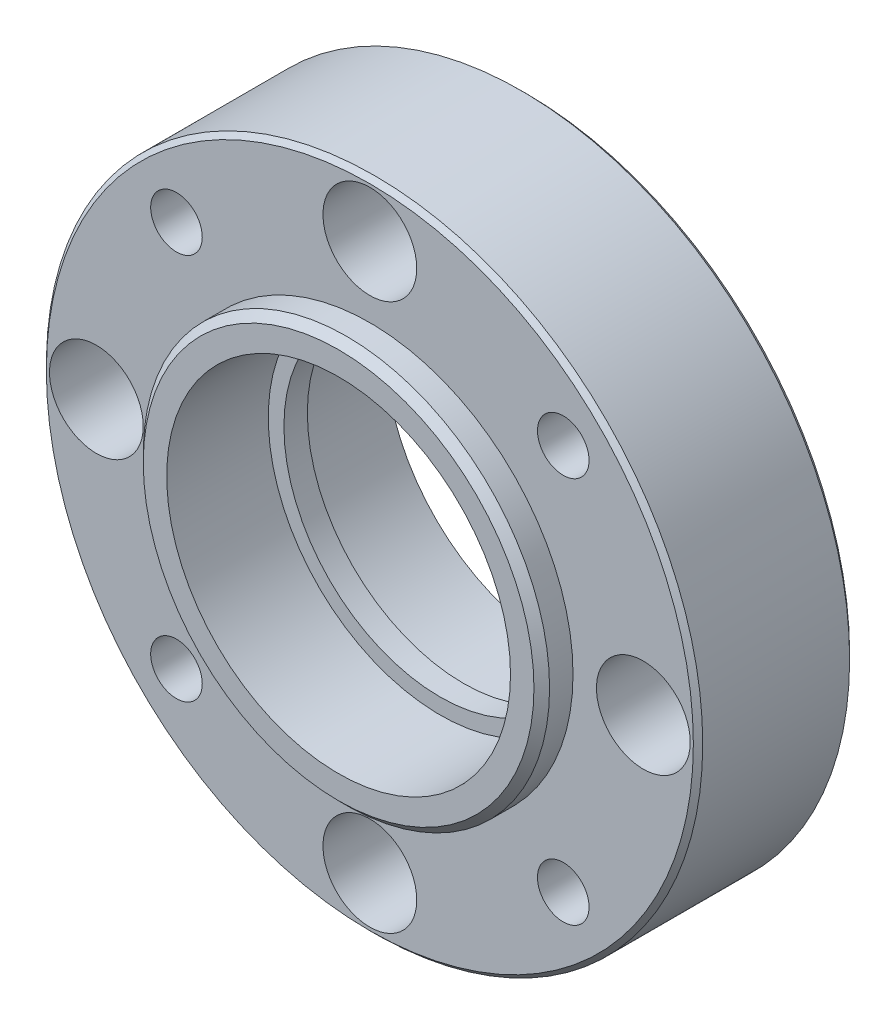
ISO-10303-21;
HEADER;
FILE_DESCRIPTION(('STEP AP214'),'2;1');
FILE_NAME('part.step','',(''),(''),'','','');
FILE_SCHEMA(('AUTOMOTIVE_DESIGN { 1 0 10303 214 1 1 1 1 }'));
ENDSEC;
DATA;
#1=APPLICATION_CONTEXT('core data for automotive mechanical design processes');
#2=APPLICATION_PROTOCOL_DEFINITION('international standard','automotive_design',2000,#1);
#3=PRODUCT_CONTEXT('',#1,'mechanical');
#4=PRODUCT('Part','Part','',(#3));
#5=PRODUCT_RELATED_PRODUCT_CATEGORY('part','',(#4));
#6=PRODUCT_DEFINITION_FORMATION('','',#4);
#7=PRODUCT_DEFINITION_CONTEXT('part definition',#1,'design');
#8=PRODUCT_DEFINITION('design','',#6,#7);
#9=PRODUCT_DEFINITION_SHAPE('','',#8);
#10=(LENGTH_UNIT() NAMED_UNIT(*) SI_UNIT(.MILLI.,.METRE.));
#11=(NAMED_UNIT(*) PLANE_ANGLE_UNIT() SI_UNIT($,.RADIAN.));
#12=(NAMED_UNIT(*) SI_UNIT($,.STERADIAN.) SOLID_ANGLE_UNIT());
#13=UNCERTAINTY_MEASURE_WITH_UNIT(LENGTH_MEASURE(1.E-05),#10,'distance_accuracy_value','');
#14=(GEOMETRIC_REPRESENTATION_CONTEXT(3) GLOBAL_UNCERTAINTY_ASSIGNED_CONTEXT((#13)) GLOBAL_UNIT_ASSIGNED_CONTEXT((#10,
#11,#12)) REPRESENTATION_CONTEXT('',''));
#15=CARTESIAN_POINT('',(0.,0.,0.));
#16=DIRECTION('',(0.,0.,1.));
#17=DIRECTION('',(1.,0.,0.));
#18=AXIS2_PLACEMENT_3D('',#15,#16,#17);
#19=CARTESIAN_POINT('',(0.,-10.,0.499999999999996));
#20=DIRECTION('',(0.,0.,1.));
#21=DIRECTION('',(1.,0.,0.));
#22=AXIS2_PLACEMENT_3D('',#19,#20,#21);
#23=PLANE('',#22);
#24=CARTESIAN_POINT('',(0.,0.,0.499999999999997));
#25=DIRECTION('',(0.,0.,1.));
#26=DIRECTION('',(1.,0.,0.));
#27=AXIS2_PLACEMENT_3D('',#24,#25,#26);
#28=CIRCLE('',#27,10.);
#29=CARTESIAN_POINT('',(10.,0.,0.499999999999997));
#30=VERTEX_POINT('',#29);
#31=EDGE_CURVE('E129',#30,#30,#28,.F.);
#32=ORIENTED_EDGE('',*,*,#31,.T.);
#33=EDGE_LOOP('',(#32));
#34=FACE_BOUND('',#33,.T.);
#35=CARTESIAN_POINT('',(0.,0.,0.499999999999997));
#36=DIRECTION('',(0.,0.,1.));
#37=DIRECTION('',(1.,0.,0.));
#38=AXIS2_PLACEMENT_3D('',#35,#36,#37);
#39=CIRCLE('',#38,11.);
#40=CARTESIAN_POINT('',(11.,0.,0.499999999999997));
#41=VERTEX_POINT('',#40);
#42=EDGE_CURVE('E17',#41,#41,#39,.T.);
#43=ORIENTED_EDGE('',*,*,#42,.T.);
#44=EDGE_LOOP('',(#43));
#45=FACE_BOUND('',#44,.T.);
#46=ADVANCED_FACE('F14',(#34,#45),#23,.T.);
#47=CARTESIAN_POINT('',(0.,0.,24.1192163114095));
#48=DIRECTION('',(0.,0.,1.));
#49=DIRECTION('',(1.,0.,0.));
#50=AXIS2_PLACEMENT_3D('',#47,#48,#49);
#51=CYLINDRICAL_SURFACE('',#50,11.);
#52=CARTESIAN_POINT('',(0.,0.,7.));
#53=DIRECTION('',(0.,0.,1.));
#54=DIRECTION('',(1.,0.,0.));
#55=AXIS2_PLACEMENT_3D('',#52,#53,#54);
#56=CIRCLE('',#55,11.);
#57=CARTESIAN_POINT('',(11.,0.,7.));
#58=VERTEX_POINT('',#57);
#59=EDGE_CURVE('E127',#58,#58,#56,.F.);
#60=ORIENTED_EDGE('',*,*,#59,.F.);
#61=EDGE_LOOP('',(#60));
#62=FACE_BOUND('',#61,.T.);
#63=ORIENTED_EDGE('',*,*,#42,.F.);
#64=EDGE_LOOP('',(#63));
#65=FACE_BOUND('',#64,.T.);
#66=ADVANCED_FACE('F137',(#62,#65),#51,.F.);
#67=CARTESIAN_POINT('',(0.,0.,24.1192163114095));
#68=DIRECTION('',(0.,0.,1.));
#69=DIRECTION('',(1.,0.,0.));
#70=AXIS2_PLACEMENT_3D('',#67,#68,#69);
#71=CYLINDRICAL_SURFACE('',#70,10.);
#72=ORIENTED_EDGE('',*,*,#31,.F.);
#73=EDGE_LOOP('',(#72));
#74=FACE_BOUND('',#73,.T.);
#75=CARTESIAN_POINT('',(0.,0.,-1.));
#76=DIRECTION('',(0.,0.,1.));
#77=DIRECTION('',(1.,0.,0.));
#78=AXIS2_PLACEMENT_3D('',#75,#76,#77);
#79=CIRCLE('',#78,10.);
#80=CARTESIAN_POINT('',(10.,0.,-1.));
#81=VERTEX_POINT('',#80);
#82=EDGE_CURVE('E124',#81,#81,#79,.T.);
#83=ORIENTED_EDGE('',*,*,#82,.F.);
#84=EDGE_LOOP('',(#83));
#85=FACE_BOUND('',#84,.T.);
#86=ADVANCED_FACE('F139',(#74,#85),#71,.F.);
#87=CARTESIAN_POINT('',(0.,-11.,7.));
#88=DIRECTION('',(0.,0.,1.));
#89=DIRECTION('',(1.,0.,0.));
#90=AXIS2_PLACEMENT_3D('',#87,#88,#89);
#91=PLANE('',#90);
#92=ORIENTED_EDGE('',*,*,#59,.T.);
#93=EDGE_LOOP('',(#92));
#94=FACE_BOUND('',#93,.T.);
#95=CARTESIAN_POINT('',(0.,0.,7.));
#96=DIRECTION('',(0.,0.,-1.));
#97=DIRECTION('',(0.,1.,0.));
#98=AXIS2_PLACEMENT_3D('',#95,#96,#97);
#99=CIRCLE('',#98,12.5);
#100=CARTESIAN_POINT('',(0.,12.5,7.));
#101=VERTEX_POINT('',#100);
#102=EDGE_CURVE('E121',#101,#101,#99,.T.);
#103=ORIENTED_EDGE('',*,*,#102,.F.);
#104=EDGE_LOOP('',(#103));
#105=FACE_BOUND('',#104,.T.);
#106=ADVANCED_FACE('F146',(#94,#105),#91,.T.);
#107=CARTESIAN_POINT('',(0.,-11.,-1.));
#108=DIRECTION('',(0.,0.,-1.));
#109=DIRECTION('',(-1.,0.,0.));
#110=AXIS2_PLACEMENT_3D('',#107,#108,#109);
#111=PLANE('',#110);
#112=CARTESIAN_POINT('',(0.,0.,-1.));
#113=DIRECTION('',(0.,0.,1.));
#114=DIRECTION('',(1.,0.,0.));
#115=AXIS2_PLACEMENT_3D('',#112,#113,#114);
#116=CIRCLE('',#115,11.);
#117=CARTESIAN_POINT('',(11.,0.,-1.));
#118=VERTEX_POINT('',#117);
#119=EDGE_CURVE('E118',#118,#118,#116,.F.);
#120=ORIENTED_EDGE('',*,*,#119,.T.);
#121=EDGE_LOOP('',(#120));
#122=FACE_BOUND('',#121,.T.);
#123=ORIENTED_EDGE('',*,*,#82,.T.);
#124=EDGE_LOOP('',(#123));
#125=FACE_BOUND('',#124,.T.);
#126=ADVANCED_FACE('F261',(#122,#125),#111,.T.);
#127=CARTESIAN_POINT('',(0.,0.,6.5));
#128=DIRECTION('',(0.,0.,-1.));
#129=DIRECTION('',(0.,1.,0.));
#130=AXIS2_PLACEMENT_3D('',#127,#128,#129);
#131=CONICAL_SURFACE('',#130,13.,0.785398163397457);
#132=ORIENTED_EDGE('',*,*,#102,.T.);
#133=EDGE_LOOP('',(#132));
#134=FACE_BOUND('',#133,.T.);
#135=CARTESIAN_POINT('',(0.,0.,6.5));
#136=DIRECTION('',(0.,0.,1.));
#137=DIRECTION('',(1.,0.,0.));
#138=AXIS2_PLACEMENT_3D('',#135,#136,#137);
#139=CIRCLE('',#138,13.);
#140=CARTESIAN_POINT('',(13.,0.,6.5));
#141=VERTEX_POINT('',#140);
#142=EDGE_CURVE('E29',#141,#141,#139,.F.);
#143=ORIENTED_EDGE('',*,*,#142,.F.);
#144=EDGE_LOOP('',(#143));
#145=FACE_BOUND('',#144,.T.);
#146=ADVANCED_FACE('F257',(#134,#145),#131,.T.);
#147=CARTESIAN_POINT('',(0.,0.,24.1192163114095));
#148=DIRECTION('',(0.,0.,1.));
#149=DIRECTION('',(1.,0.,0.));
#150=AXIS2_PLACEMENT_3D('',#147,#148,#149);
#151=CYLINDRICAL_SURFACE('',#150,11.);
#152=ORIENTED_EDGE('',*,*,#119,.F.);
#153=EDGE_LOOP('',(#152));
#154=FACE_BOUND('',#153,.T.);
#155=CARTESIAN_POINT('',(0.,0.,-7.00000000000001));
#156=DIRECTION('',(0.,0.,1.));
#157=DIRECTION('',(1.,0.,0.));
#158=AXIS2_PLACEMENT_3D('',#155,#156,#157);
#159=CIRCLE('',#158,11.);
#160=CARTESIAN_POINT('',(11.,0.,-7.00000000000001));
#161=VERTEX_POINT('',#160);
#162=EDGE_CURVE('E115',#161,#161,#159,.T.);
#163=ORIENTED_EDGE('',*,*,#162,.F.);
#164=EDGE_LOOP('',(#163));
#165=FACE_BOUND('',#164,.T.);
#166=ADVANCED_FACE('F253',(#154,#165),#151,.F.);
#167=CARTESIAN_POINT('',(0.,0.,4.69999999999997));
#168=DIRECTION('',(0.,0.,-1.));
#169=DIRECTION('',(0.,1.,0.));
#170=AXIS2_PLACEMENT_3D('',#167,#168,#169);
#171=CONICAL_SURFACE('',#170,21.,0.785398163397458);
#172=CARTESIAN_POINT('',(0.,0.,4.69999999999998));
#173=DIRECTION('',(0.,0.,1.));
#174=DIRECTION('',(1.,0.,0.));
#175=AXIS2_PLACEMENT_3D('',#172,#173,#174);
#176=CIRCLE('',#175,21.);
#177=CARTESIAN_POINT('',(21.,0.,4.69999999999998));
#178=VERTEX_POINT('',#177);
#179=EDGE_CURVE('E114',#178,#178,#176,.F.);
#180=ORIENTED_EDGE('',*,*,#179,.F.);
#181=EDGE_LOOP('',(#180));
#182=FACE_BOUND('',#181,.T.);
#183=CARTESIAN_POINT('',(0.,0.,4.99999999999999));
#184=DIRECTION('',(0.,0.,-1.));
#185=DIRECTION('',(0.,1.,0.));
#186=AXIS2_PLACEMENT_3D('',#183,#184,#185);
#187=CIRCLE('',#186,20.7);
#188=CARTESIAN_POINT('',(0.,20.7,4.99999999999999));
#189=VERTEX_POINT('',#188);
#190=EDGE_CURVE('E111',#189,#189,#187,.F.);
#191=ORIENTED_EDGE('',*,*,#190,.F.);
#192=EDGE_LOOP('',(#191));
#193=FACE_BOUND('',#192,.T.);
#194=ADVANCED_FACE('F249',(#182,#193),#171,.T.);
#195=CARTESIAN_POINT('',(0.,0.,24.1192163114095));
#196=DIRECTION('',(0.,0.,1.));
#197=DIRECTION('',(1.,0.,0.));
#198=AXIS2_PLACEMENT_3D('',#195,#196,#197);
#199=CYLINDRICAL_SURFACE('',#198,13.);
#200=CARTESIAN_POINT('',(0.,0.,4.99999999999999));
#201=DIRECTION('',(0.,0.,1.));
#202=DIRECTION('',(1.,0.,0.));
#203=AXIS2_PLACEMENT_3D('',#200,#201,#202);
#204=CIRCLE('',#203,13.);
#205=CARTESIAN_POINT('',(13.,0.,4.99999999999999));
#206=VERTEX_POINT('',#205);
#207=EDGE_CURVE('E96',#206,#206,#204,.F.);
#208=ORIENTED_EDGE('',*,*,#207,.F.);
#209=EDGE_LOOP('',(#208));
#210=FACE_BOUND('',#209,.T.);
#211=ORIENTED_EDGE('',*,*,#142,.T.);
#212=EDGE_LOOP('',(#211));
#213=FACE_BOUND('',#212,.T.);
#214=ADVANCED_FACE('F245',(#210,#213),#199,.T.);
#215=CARTESIAN_POINT('',(0.,17.5,4.99999999999999));
#216=DIRECTION('',(0.,0.,1.));
#217=DIRECTION('',(1.,0.,0.));
#218=AXIS2_PLACEMENT_3D('',#215,#216,#217);
#219=CYLINDRICAL_SURFACE('',#218,3.);
#220=CARTESIAN_POINT('',(0.,17.5,0.));
#221=DIRECTION('',(0.,0.,1.));
#222=DIRECTION('',(1.,0.,0.));
#223=AXIS2_PLACEMENT_3D('',#220,#221,#222);
#224=CIRCLE('',#223,3.);
#225=CARTESIAN_POINT('',(3.,17.5,0.));
#226=VERTEX_POINT('',#225);
#227=EDGE_CURVE('E93',#226,#226,#224,.F.);
#228=ORIENTED_EDGE('',*,*,#227,.T.);
#229=EDGE_LOOP('',(#228));
#230=FACE_BOUND('',#229,.T.);
#231=CARTESIAN_POINT('',(0.,17.5,4.99999999999999));
#232=DIRECTION('',(0.,0.,1.));
#233=DIRECTION('',(1.,0.,0.));
#234=AXIS2_PLACEMENT_3D('',#231,#232,#233);
#235=CIRCLE('',#234,3.);
#236=CARTESIAN_POINT('',(3.,17.5,4.99999999999999));
#237=VERTEX_POINT('',#236);
#238=EDGE_CURVE('E108',#237,#237,#235,.F.);
#239=ORIENTED_EDGE('',*,*,#238,.F.);
#240=EDGE_LOOP('',(#239));
#241=FACE_BOUND('',#240,.T.);
#242=ADVANCED_FACE('F241',(#230,#241),#219,.F.);
#243=CARTESIAN_POINT('',(17.5,0.,4.99999999999999));
#244=DIRECTION('',(0.,0.,1.));
#245=DIRECTION('',(1.,0.,0.));
#246=AXIS2_PLACEMENT_3D('',#243,#244,#245);
#247=CYLINDRICAL_SURFACE('',#246,3.);
#248=CARTESIAN_POINT('',(17.5,0.,0.));
#249=DIRECTION('',(0.,0.,1.));
#250=DIRECTION('',(1.,0.,0.));
#251=AXIS2_PLACEMENT_3D('',#248,#249,#250);
#252=CIRCLE('',#251,3.);
#253=CARTESIAN_POINT('',(20.5,0.,0.));
#254=VERTEX_POINT('',#253);
#255=EDGE_CURVE('E90',#254,#254,#252,.F.);
#256=ORIENTED_EDGE('',*,*,#255,.T.);
#257=EDGE_LOOP('',(#256));
#258=FACE_BOUND('',#257,.T.);
#259=CARTESIAN_POINT('',(17.5,0.,4.99999999999999));
#260=DIRECTION('',(0.,0.,1.));
#261=DIRECTION('',(1.,0.,0.));
#262=AXIS2_PLACEMENT_3D('',#259,#260,#261);
#263=CIRCLE('',#262,3.);
#264=CARTESIAN_POINT('',(20.5,0.,4.99999999999999));
#265=VERTEX_POINT('',#264);
#266=EDGE_CURVE('E105',#265,#265,#263,.F.);
#267=ORIENTED_EDGE('',*,*,#266,.F.);
#268=EDGE_LOOP('',(#267));
#269=FACE_BOUND('',#268,.T.);
#270=ADVANCED_FACE('F237',(#258,#269),#247,.F.);
#271=CARTESIAN_POINT('',(0.,-17.5,4.99999999999999));
#272=DIRECTION('',(0.,0.,1.));
#273=DIRECTION('',(1.,0.,0.));
#274=AXIS2_PLACEMENT_3D('',#271,#272,#273);
#275=CYLINDRICAL_SURFACE('',#274,3.);
#276=CARTESIAN_POINT('',(0.,-17.5,0.));
#277=DIRECTION('',(0.,0.,1.));
#278=DIRECTION('',(1.,0.,0.));
#279=AXIS2_PLACEMENT_3D('',#276,#277,#278);
#280=CIRCLE('',#279,3.);
#281=CARTESIAN_POINT('',(3.,-17.5,0.));
#282=VERTEX_POINT('',#281);
#283=EDGE_CURVE('E87',#282,#282,#280,.F.);
#284=ORIENTED_EDGE('',*,*,#283,.T.);
#285=EDGE_LOOP('',(#284));
#286=FACE_BOUND('',#285,.T.);
#287=CARTESIAN_POINT('',(0.,-17.5,4.99999999999999));
#288=DIRECTION('',(0.,0.,1.));
#289=DIRECTION('',(1.,0.,0.));
#290=AXIS2_PLACEMENT_3D('',#287,#288,#289);
#291=CIRCLE('',#290,3.);
#292=CARTESIAN_POINT('',(3.,-17.5,4.99999999999999));
#293=VERTEX_POINT('',#292);
#294=EDGE_CURVE('E102',#293,#293,#291,.F.);
#295=ORIENTED_EDGE('',*,*,#294,.F.);
#296=EDGE_LOOP('',(#295));
#297=FACE_BOUND('',#296,.T.);
#298=ADVANCED_FACE('F233',(#286,#297),#275,.F.);
#299=CARTESIAN_POINT('',(-17.5,0.,4.99999999999999));
#300=DIRECTION('',(0.,0.,1.));
#301=DIRECTION('',(1.,0.,0.));
#302=AXIS2_PLACEMENT_3D('',#299,#300,#301);
#303=CYLINDRICAL_SURFACE('',#302,3.);
#304=CARTESIAN_POINT('',(-17.5,0.,0.));
#305=DIRECTION('',(0.,0.,1.));
#306=DIRECTION('',(1.,0.,0.));
#307=AXIS2_PLACEMENT_3D('',#304,#305,#306);
#308=CIRCLE('',#307,3.);
#309=CARTESIAN_POINT('',(-14.5,0.,0.));
#310=VERTEX_POINT('',#309);
#311=EDGE_CURVE('E84',#310,#310,#308,.F.);
#312=ORIENTED_EDGE('',*,*,#311,.T.);
#313=EDGE_LOOP('',(#312));
#314=FACE_BOUND('',#313,.T.);
#315=CARTESIAN_POINT('',(-17.5,0.,4.99999999999999));
#316=DIRECTION('',(0.,0.,1.));
#317=DIRECTION('',(1.,0.,0.));
#318=AXIS2_PLACEMENT_3D('',#315,#316,#317);
#319=CIRCLE('',#318,3.);
#320=CARTESIAN_POINT('',(-14.5,0.,4.99999999999999));
#321=VERTEX_POINT('',#320);
#322=EDGE_CURVE('E99',#321,#321,#319,.F.);
#323=ORIENTED_EDGE('',*,*,#322,.F.);
#324=EDGE_LOOP('',(#323));
#325=FACE_BOUND('',#324,.T.);
#326=ADVANCED_FACE('F229',(#314,#325),#303,.F.);
#327=CARTESIAN_POINT('',(0.,-13.4,-7.));
#328=DIRECTION('',(0.,0.,-1.));
#329=DIRECTION('',(-1.,0.,0.));
#330=AXIS2_PLACEMENT_3D('',#327,#328,#329);
#331=PLANE('',#330);
#332=ORIENTED_EDGE('',*,*,#162,.T.);
#333=EDGE_LOOP('',(#332));
#334=FACE_BOUND('',#333,.T.);
#335=CARTESIAN_POINT('',(0.,0.,-7.));
#336=DIRECTION('',(0.,0.,1.));
#337=DIRECTION('',(1.,0.,0.));
#338=AXIS2_PLACEMENT_3D('',#335,#336,#337);
#339=CIRCLE('',#338,12.9);
#340=CARTESIAN_POINT('',(12.9,0.,-7.));
#341=VERTEX_POINT('',#340);
#342=EDGE_CURVE('E81',#341,#341,#339,.T.);
#343=ORIENTED_EDGE('',*,*,#342,.F.);
#344=EDGE_LOOP('',(#343));
#345=FACE_BOUND('',#344,.T.);
#346=ADVANCED_FACE('F225',(#334,#345),#331,.T.);
#347=CARTESIAN_POINT('',(0.,0.,24.1192163114095));
#348=DIRECTION('',(0.,0.,1.));
#349=DIRECTION('',(1.,0.,0.));
#350=AXIS2_PLACEMENT_3D('',#347,#348,#349);
#351=CYLINDRICAL_SURFACE('',#350,21.);
#352=ORIENTED_EDGE('',*,*,#179,.T.);
#353=EDGE_LOOP('',(#352));
#354=FACE_BOUND('',#353,.T.);
#355=CARTESIAN_POINT('',(0.,0.,-4.69999999999999));
#356=DIRECTION('',(0.,0.,1.));
#357=DIRECTION('',(1.,0.,0.));
#358=AXIS2_PLACEMENT_3D('',#355,#356,#357);
#359=CIRCLE('',#358,21.);
#360=CARTESIAN_POINT('',(21.,0.,-4.69999999999998));
#361=VERTEX_POINT('',#360);
#362=EDGE_CURVE('E80',#361,#361,#359,.F.);
#363=ORIENTED_EDGE('',*,*,#362,.F.);
#364=EDGE_LOOP('',(#363));
#365=FACE_BOUND('',#364,.T.);
#366=ADVANCED_FACE('F221',(#354,#365),#351,.T.);
#367=CARTESIAN_POINT('',(0.,-13.,4.99999999999999));
#368=DIRECTION('',(0.,0.,1.));
#369=DIRECTION('',(1.,0.,0.));
#370=AXIS2_PLACEMENT_3D('',#367,#368,#369);
#371=PLANE('',#370);
#372=ORIENTED_EDGE('',*,*,#207,.T.);
#373=EDGE_LOOP('',(#372));
#374=FACE_BOUND('',#373,.T.);
#375=ORIENTED_EDGE('',*,*,#322,.T.);
#376=EDGE_LOOP('',(#375));
#377=FACE_BOUND('',#376,.T.);
#378=ORIENTED_EDGE('',*,*,#294,.T.);
#379=EDGE_LOOP('',(#378));
#380=FACE_BOUND('',#379,.T.);
#381=ORIENTED_EDGE('',*,*,#266,.T.);
#382=EDGE_LOOP('',(#381));
#383=FACE_BOUND('',#382,.T.);
#384=ORIENTED_EDGE('',*,*,#238,.T.);
#385=EDGE_LOOP('',(#384));
#386=FACE_BOUND('',#385,.T.);
#387=CARTESIAN_POINT('',(-12.3743686707646,-12.3743686707646,5.));
#388=DIRECTION('',(0.,0.,1.));
#389=DIRECTION('',(1.,0.,0.));
#390=AXIS2_PLACEMENT_3D('',#387,#388,#389);
#391=CIRCLE('',#390,1.64999999999999);
#392=CARTESIAN_POINT('',(-10.7243686707646,-12.3743686707646,5.));
#393=VERTEX_POINT('',#392);
#394=EDGE_CURVE('E68',#393,#393,#391,.F.);
#395=ORIENTED_EDGE('',*,*,#394,.T.);
#396=EDGE_LOOP('',(#395));
#397=FACE_BOUND('',#396,.T.);
#398=CARTESIAN_POINT('',(12.3743686707646,-12.3743686707646,5.));
#399=DIRECTION('',(0.,0.,1.));
#400=DIRECTION('',(1.,0.,0.));
#401=AXIS2_PLACEMENT_3D('',#398,#399,#400);
#402=CIRCLE('',#401,1.64999999999999);
#403=CARTESIAN_POINT('',(14.0243686707646,-12.3743686707646,5.));
#404=VERTEX_POINT('',#403);
#405=EDGE_CURVE('E71',#404,#404,#402,.F.);
#406=ORIENTED_EDGE('',*,*,#405,.T.);
#407=EDGE_LOOP('',(#406));
#408=FACE_BOUND('',#407,.T.);
#409=CARTESIAN_POINT('',(12.3743686707646,12.3743686707646,5.));
#410=DIRECTION('',(0.,0.,1.));
#411=DIRECTION('',(1.,0.,0.));
#412=AXIS2_PLACEMENT_3D('',#409,#410,#411);
#413=CIRCLE('',#412,1.64999999999999);
#414=CARTESIAN_POINT('',(14.0243686707646,12.3743686707646,5.));
#415=VERTEX_POINT('',#414);
#416=EDGE_CURVE('E74',#415,#415,#413,.F.);
#417=ORIENTED_EDGE('',*,*,#416,.T.);
#418=EDGE_LOOP('',(#417));
#419=FACE_BOUND('',#418,.T.);
#420=CARTESIAN_POINT('',(-12.3743686707646,12.3743686707646,5.));
#421=DIRECTION('',(0.,0.,1.));
#422=DIRECTION('',(1.,0.,0.));
#423=AXIS2_PLACEMENT_3D('',#420,#421,#422);
#424=CIRCLE('',#423,1.64999999999999);
#425=CARTESIAN_POINT('',(-10.7243686707646,12.3743686707646,5.));
#426=VERTEX_POINT('',#425);
#427=EDGE_CURVE('E77',#426,#426,#424,.F.);
#428=ORIENTED_EDGE('',*,*,#427,.T.);
#429=EDGE_LOOP('',(#428));
#430=FACE_BOUND('',#429,.T.);
#431=ORIENTED_EDGE('',*,*,#190,.T.);
#432=EDGE_LOOP('',(#431));
#433=FACE_BOUND('',#432,.T.);
#434=ADVANCED_FACE('F217',(#374,#377,#380,#383,#386,#397,#408,#419,#430,#433),#371,.T.);
#435=CARTESIAN_POINT('',(1.75,17.5,0.));
#436=DIRECTION('',(0.,0.,-1.));
#437=DIRECTION('',(-1.,0.,0.));
#438=AXIS2_PLACEMENT_3D('',#435,#436,#437);
#439=PLANE('',#438);
#440=ORIENTED_EDGE('',*,*,#227,.F.);
#441=EDGE_LOOP('',(#440));
#442=FACE_BOUND('',#441,.T.);
#443=CARTESIAN_POINT('',(0.,17.5,0.));
#444=DIRECTION('',(0.,0.,1.));
#445=DIRECTION('',(1.,0.,0.));
#446=AXIS2_PLACEMENT_3D('',#443,#444,#445);
#447=CIRCLE('',#446,1.75);
#448=CARTESIAN_POINT('',(1.75,17.5,0.));
#449=VERTEX_POINT('',#448);
#450=EDGE_CURVE('E65',#449,#449,#447,.F.);
#451=ORIENTED_EDGE('',*,*,#450,.T.);
#452=EDGE_LOOP('',(#451));
#453=FACE_BOUND('',#452,.T.);
#454=ADVANCED_FACE('F213',(#442,#453),#439,.F.);
#455=CARTESIAN_POINT('',(19.25,0.,0.));
#456=DIRECTION('',(0.,0.,-1.));
#457=DIRECTION('',(-1.,0.,0.));
#458=AXIS2_PLACEMENT_3D('',#455,#456,#457);
#459=PLANE('',#458);
#460=ORIENTED_EDGE('',*,*,#255,.F.);
#461=EDGE_LOOP('',(#460));
#462=FACE_BOUND('',#461,.T.);
#463=CARTESIAN_POINT('',(17.5,0.,0.));
#464=DIRECTION('',(0.,0.,1.));
#465=DIRECTION('',(1.,0.,0.));
#466=AXIS2_PLACEMENT_3D('',#463,#464,#465);
#467=CIRCLE('',#466,1.75);
#468=CARTESIAN_POINT('',(19.25,0.,0.));
#469=VERTEX_POINT('',#468);
#470=EDGE_CURVE('E62',#469,#469,#467,.F.);
#471=ORIENTED_EDGE('',*,*,#470,.T.);
#472=EDGE_LOOP('',(#471));
#473=FACE_BOUND('',#472,.T.);
#474=ADVANCED_FACE('F209',(#462,#473),#459,.F.);
#475=CARTESIAN_POINT('',(1.75,-17.5,0.));
#476=DIRECTION('',(0.,0.,-1.));
#477=DIRECTION('',(-1.,0.,0.));
#478=AXIS2_PLACEMENT_3D('',#475,#476,#477);
#479=PLANE('',#478);
#480=ORIENTED_EDGE('',*,*,#283,.F.);
#481=EDGE_LOOP('',(#480));
#482=FACE_BOUND('',#481,.T.);
#483=CARTESIAN_POINT('',(0.,-17.5,0.));
#484=DIRECTION('',(0.,0.,1.));
#485=DIRECTION('',(1.,0.,0.));
#486=AXIS2_PLACEMENT_3D('',#483,#484,#485);
#487=CIRCLE('',#486,1.75);
#488=CARTESIAN_POINT('',(1.75,-17.5,0.));
#489=VERTEX_POINT('',#488);
#490=EDGE_CURVE('E59',#489,#489,#487,.F.);
#491=ORIENTED_EDGE('',*,*,#490,.T.);
#492=EDGE_LOOP('',(#491));
#493=FACE_BOUND('',#492,.T.);
#494=ADVANCED_FACE('F205',(#482,#493),#479,.F.);
#495=CARTESIAN_POINT('',(-15.75,0.,0.));
#496=DIRECTION('',(0.,0.,-1.));
#497=DIRECTION('',(-1.,0.,0.));
#498=AXIS2_PLACEMENT_3D('',#495,#496,#497);
#499=PLANE('',#498);
#500=ORIENTED_EDGE('',*,*,#311,.F.);
#501=EDGE_LOOP('',(#500));
#502=FACE_BOUND('',#501,.T.);
#503=CARTESIAN_POINT('',(-17.5,0.,0.));
#504=DIRECTION('',(0.,0.,1.));
#505=DIRECTION('',(1.,0.,0.));
#506=AXIS2_PLACEMENT_3D('',#503,#504,#505);
#507=CIRCLE('',#506,1.75);
#508=CARTESIAN_POINT('',(-15.75,0.,0.));
#509=VERTEX_POINT('',#508);
#510=EDGE_CURVE('E56',#509,#509,#507,.F.);
#511=ORIENTED_EDGE('',*,*,#510,.T.);
#512=EDGE_LOOP('',(#511));
#513=FACE_BOUND('',#512,.T.);
#514=ADVANCED_FACE('F201',(#502,#513),#499,.F.);
#515=CARTESIAN_POINT('',(0.,0.,-6.50000000000002));
#516=DIRECTION('',(0.,0.,1.));
#517=DIRECTION('',(1.,0.,0.));
#518=AXIS2_PLACEMENT_3D('',#515,#516,#517);
#519=CONICAL_SURFACE('',#518,13.4,0.785398163397452);
#520=ORIENTED_EDGE('',*,*,#342,.T.);
#521=EDGE_LOOP('',(#520));
#522=FACE_BOUND('',#521,.T.);
#523=CARTESIAN_POINT('',(0.,0.,-6.50000000000002));
#524=DIRECTION('',(0.,0.,1.));
#525=DIRECTION('',(1.,0.,0.));
#526=AXIS2_PLACEMENT_3D('',#523,#524,#525);
#527=CIRCLE('',#526,13.4);
#528=CARTESIAN_POINT('',(13.4,0.,-6.50000000000002));
#529=VERTEX_POINT('',#528);
#530=EDGE_CURVE('E55',#529,#529,#527,.T.);
#531=ORIENTED_EDGE('',*,*,#530,.F.);
#532=EDGE_LOOP('',(#531));
#533=FACE_BOUND('',#532,.T.);
#534=ADVANCED_FACE('F197',(#522,#533),#519,.T.);
#535=CARTESIAN_POINT('',(0.,0.,-4.69999999999998));
#536=DIRECTION('',(0.,0.,1.));
#537=DIRECTION('',(1.,0.,0.));
#538=AXIS2_PLACEMENT_3D('',#535,#536,#537);
#539=CONICAL_SURFACE('',#538,21.,0.785398163397441);
#540=ORIENTED_EDGE('',*,*,#362,.T.);
#541=EDGE_LOOP('',(#540));
#542=FACE_BOUND('',#541,.T.);
#543=CARTESIAN_POINT('',(0.,0.,-5.));
#544=DIRECTION('',(0.,0.,1.));
#545=DIRECTION('',(1.,0.,0.));
#546=AXIS2_PLACEMENT_3D('',#543,#544,#545);
#547=CIRCLE('',#546,20.7);
#548=CARTESIAN_POINT('',(20.7,0.,-5.));
#549=VERTEX_POINT('',#548);
#550=EDGE_CURVE('E52',#549,#549,#547,.F.);
#551=ORIENTED_EDGE('',*,*,#550,.F.);
#552=EDGE_LOOP('',(#551));
#553=FACE_BOUND('',#552,.T.);
#554=ADVANCED_FACE('F193',(#542,#553),#539,.T.);
#555=CARTESIAN_POINT('',(-12.3743686707646,12.3743686707646,4.99999999999999));
#556=DIRECTION('',(0.,0.,1.));
#557=DIRECTION('',(1.,0.,0.));
#558=AXIS2_PLACEMENT_3D('',#555,#556,#557);
#559=CYLINDRICAL_SURFACE('',#558,1.64999999999999);
#560=CARTESIAN_POINT('',(-12.3743686707646,12.3743686707646,-5.));
#561=DIRECTION('',(0.,0.,1.));
#562=DIRECTION('',(1.,0.,0.));
#563=AXIS2_PLACEMENT_3D('',#560,#561,#562);
#564=CIRCLE('',#563,1.64999999999999);
#565=CARTESIAN_POINT('',(-10.7243686707646,12.3743686707646,-5.));
#566=VERTEX_POINT('',#565);
#567=EDGE_CURVE('E49',#566,#566,#564,.T.);
#568=ORIENTED_EDGE('',*,*,#567,.F.);
#569=EDGE_LOOP('',(#568));
#570=FACE_BOUND('',#569,.T.);
#571=ORIENTED_EDGE('',*,*,#427,.F.);
#572=EDGE_LOOP('',(#571));
#573=FACE_BOUND('',#572,.T.);
#574=ADVANCED_FACE('F189',(#570,#573),#559,.F.);
#575=CARTESIAN_POINT('',(12.3743686707646,12.3743686707646,4.99999999999999));
#576=DIRECTION('',(0.,0.,1.));
#577=DIRECTION('',(1.,0.,0.));
#578=AXIS2_PLACEMENT_3D('',#575,#576,#577);
#579=CYLINDRICAL_SURFACE('',#578,1.64999999999999);
#580=CARTESIAN_POINT('',(12.3743686707646,12.3743686707646,-5.));
#581=DIRECTION('',(0.,0.,1.));
#582=DIRECTION('',(1.,0.,0.));
#583=AXIS2_PLACEMENT_3D('',#580,#581,#582);
#584=CIRCLE('',#583,1.64999999999999);
#585=CARTESIAN_POINT('',(14.0243686707646,12.3743686707646,-5.));
#586=VERTEX_POINT('',#585);
#587=EDGE_CURVE('E46',#586,#586,#584,.T.);
#588=ORIENTED_EDGE('',*,*,#587,.F.);
#589=EDGE_LOOP('',(#588));
#590=FACE_BOUND('',#589,.T.);
#591=ORIENTED_EDGE('',*,*,#416,.F.);
#592=EDGE_LOOP('',(#591));
#593=FACE_BOUND('',#592,.T.);
#594=ADVANCED_FACE('F185',(#590,#593),#579,.F.);
#595=CARTESIAN_POINT('',(12.3743686707646,-12.3743686707646,4.99999999999999));
#596=DIRECTION('',(0.,0.,1.));
#597=DIRECTION('',(1.,0.,0.));
#598=AXIS2_PLACEMENT_3D('',#595,#596,#597);
#599=CYLINDRICAL_SURFACE('',#598,1.64999999999999);
#600=CARTESIAN_POINT('',(12.3743686707646,-12.3743686707646,-5.));
#601=DIRECTION('',(0.,0.,1.));
#602=DIRECTION('',(1.,0.,0.));
#603=AXIS2_PLACEMENT_3D('',#600,#601,#602);
#604=CIRCLE('',#603,1.64999999999999);
#605=CARTESIAN_POINT('',(14.0243686707646,-12.3743686707646,-5.));
#606=VERTEX_POINT('',#605);
#607=EDGE_CURVE('E43',#606,#606,#604,.T.);
#608=ORIENTED_EDGE('',*,*,#607,.F.);
#609=EDGE_LOOP('',(#608));
#610=FACE_BOUND('',#609,.T.);
#611=ORIENTED_EDGE('',*,*,#405,.F.);
#612=EDGE_LOOP('',(#611));
#613=FACE_BOUND('',#612,.T.);
#614=ADVANCED_FACE('F181',(#610,#613),#599,.F.);
#615=CARTESIAN_POINT('',(-12.3743686707646,-12.3743686707646,4.99999999999999));
#616=DIRECTION('',(0.,0.,1.));
#617=DIRECTION('',(1.,0.,0.));
#618=AXIS2_PLACEMENT_3D('',#615,#616,#617);
#619=CYLINDRICAL_SURFACE('',#618,1.64999999999999);
#620=CARTESIAN_POINT('',(-12.3743686707646,-12.3743686707646,-5.));
#621=DIRECTION('',(0.,0.,1.));
#622=DIRECTION('',(1.,0.,0.));
#623=AXIS2_PLACEMENT_3D('',#620,#621,#622);
#624=CIRCLE('',#623,1.64999999999999);
#625=CARTESIAN_POINT('',(-10.7243686707646,-12.3743686707646,-5.));
#626=VERTEX_POINT('',#625);
#627=EDGE_CURVE('E40',#626,#626,#624,.T.);
#628=ORIENTED_EDGE('',*,*,#627,.F.);
#629=EDGE_LOOP('',(#628));
#630=FACE_BOUND('',#629,.T.);
#631=ORIENTED_EDGE('',*,*,#394,.F.);
#632=EDGE_LOOP('',(#631));
#633=FACE_BOUND('',#632,.T.);
#634=ADVANCED_FACE('F177',(#630,#633),#619,.F.);
#635=CARTESIAN_POINT('',(0.,17.5,4.99999999999999));
#636=DIRECTION('',(0.,0.,1.));
#637=DIRECTION('',(1.,0.,0.));
#638=AXIS2_PLACEMENT_3D('',#635,#636,#637);
#639=CYLINDRICAL_SURFACE('',#638,1.75);
#640=CARTESIAN_POINT('',(0.,17.5,-5.));
#641=DIRECTION('',(0.,0.,1.));
#642=DIRECTION('',(1.,0.,0.));
#643=AXIS2_PLACEMENT_3D('',#640,#641,#642);
#644=CIRCLE('',#643,1.75);
#645=CARTESIAN_POINT('',(1.75,17.5,-5.));
#646=VERTEX_POINT('',#645);
#647=EDGE_CURVE('E37',#646,#646,#644,.T.);
#648=ORIENTED_EDGE('',*,*,#647,.F.);
#649=EDGE_LOOP('',(#648));
#650=FACE_BOUND('',#649,.T.);
#651=ORIENTED_EDGE('',*,*,#450,.F.);
#652=EDGE_LOOP('',(#651));
#653=FACE_BOUND('',#652,.T.);
#654=ADVANCED_FACE('F173',(#650,#653),#639,.F.);
#655=CARTESIAN_POINT('',(17.5,0.,4.99999999999999));
#656=DIRECTION('',(0.,0.,1.));
#657=DIRECTION('',(1.,0.,0.));
#658=AXIS2_PLACEMENT_3D('',#655,#656,#657);
#659=CYLINDRICAL_SURFACE('',#658,1.75);
#660=CARTESIAN_POINT('',(17.5,0.,-5.));
#661=DIRECTION('',(0.,0.,1.));
#662=DIRECTION('',(1.,0.,0.));
#663=AXIS2_PLACEMENT_3D('',#660,#661,#662);
#664=CIRCLE('',#663,1.75);
#665=CARTESIAN_POINT('',(19.25,0.,-5.));
#666=VERTEX_POINT('',#665);
#667=EDGE_CURVE('E34',#666,#666,#664,.T.);
#668=ORIENTED_EDGE('',*,*,#667,.F.);
#669=EDGE_LOOP('',(#668));
#670=FACE_BOUND('',#669,.T.);
#671=ORIENTED_EDGE('',*,*,#470,.F.);
#672=EDGE_LOOP('',(#671));
#673=FACE_BOUND('',#672,.T.);
#674=ADVANCED_FACE('F169',(#670,#673),#659,.F.);
#675=CARTESIAN_POINT('',(0.,-17.5,4.99999999999999));
#676=DIRECTION('',(0.,0.,1.));
#677=DIRECTION('',(1.,0.,0.));
#678=AXIS2_PLACEMENT_3D('',#675,#676,#677);
#679=CYLINDRICAL_SURFACE('',#678,1.75);
#680=CARTESIAN_POINT('',(0.,-17.5,-5.));
#681=DIRECTION('',(0.,0.,1.));
#682=DIRECTION('',(1.,0.,0.));
#683=AXIS2_PLACEMENT_3D('',#680,#681,#682);
#684=CIRCLE('',#683,1.75);
#685=CARTESIAN_POINT('',(1.75,-17.5,-5.));
#686=VERTEX_POINT('',#685);
#687=EDGE_CURVE('E26',#686,#686,#684,.T.);
#688=ORIENTED_EDGE('',*,*,#687,.F.);
#689=EDGE_LOOP('',(#688));
#690=FACE_BOUND('',#689,.T.);
#691=ORIENTED_EDGE('',*,*,#490,.F.);
#692=EDGE_LOOP('',(#691));
#693=FACE_BOUND('',#692,.T.);
#694=ADVANCED_FACE('F165',(#690,#693),#679,.F.);
#695=CARTESIAN_POINT('',(-17.5,0.,4.99999999999999));
#696=DIRECTION('',(0.,0.,1.));
#697=DIRECTION('',(1.,0.,0.));
#698=AXIS2_PLACEMENT_3D('',#695,#696,#697);
#699=CYLINDRICAL_SURFACE('',#698,1.75);
#700=CARTESIAN_POINT('',(-17.5,0.,-5.));
#701=DIRECTION('',(0.,0.,1.));
#702=DIRECTION('',(1.,0.,0.));
#703=AXIS2_PLACEMENT_3D('',#700,#701,#702);
#704=CIRCLE('',#703,1.75);
#705=CARTESIAN_POINT('',(-15.75,0.,-5.));
#706=VERTEX_POINT('',#705);
#707=EDGE_CURVE('E21',#706,#706,#704,.T.);
#708=ORIENTED_EDGE('',*,*,#707,.F.);
#709=EDGE_LOOP('',(#708));
#710=FACE_BOUND('',#709,.T.);
#711=ORIENTED_EDGE('',*,*,#510,.F.);
#712=EDGE_LOOP('',(#711));
#713=FACE_BOUND('',#712,.T.);
#714=ADVANCED_FACE('F158',(#710,#713),#699,.F.);
#715=CARTESIAN_POINT('',(0.,0.,24.1192163114095));
#716=DIRECTION('',(0.,0.,1.));
#717=DIRECTION('',(1.,0.,0.));
#718=AXIS2_PLACEMENT_3D('',#715,#716,#717);
#719=CYLINDRICAL_SURFACE('',#718,13.4);
#720=ORIENTED_EDGE('',*,*,#530,.T.);
#721=EDGE_LOOP('',(#720));
#722=FACE_BOUND('',#721,.T.);
#723=CARTESIAN_POINT('',(0.,0.,-5.));
#724=DIRECTION('',(0.,0.,1.));
#725=DIRECTION('',(1.,0.,0.));
#726=AXIS2_PLACEMENT_3D('',#723,#724,#725);
#727=CIRCLE('',#726,13.4);
#728=CARTESIAN_POINT('',(13.4,0.,-5.));
#729=VERTEX_POINT('',#728);
#730=EDGE_CURVE('E10',#729,#729,#727,.T.);
#731=ORIENTED_EDGE('',*,*,#730,.F.);
#732=EDGE_LOOP('',(#731));
#733=FACE_BOUND('',#732,.T.);
#734=ADVANCED_FACE('F153',(#722,#733),#719,.T.);
#735=CARTESIAN_POINT('',(0.,-21.,-5.));
#736=DIRECTION('',(0.,0.,-1.));
#737=DIRECTION('',(-1.,0.,0.));
#738=AXIS2_PLACEMENT_3D('',#735,#736,#737);
#739=PLANE('',#738);
#740=ORIENTED_EDGE('',*,*,#730,.T.);
#741=EDGE_LOOP('',(#740));
#742=FACE_BOUND('',#741,.T.);
#743=ORIENTED_EDGE('',*,*,#707,.T.);
#744=EDGE_LOOP('',(#743));
#745=FACE_BOUND('',#744,.T.);
#746=ORIENTED_EDGE('',*,*,#687,.T.);
#747=EDGE_LOOP('',(#746));
#748=FACE_BOUND('',#747,.T.);
#749=ORIENTED_EDGE('',*,*,#667,.T.);
#750=EDGE_LOOP('',(#749));
#751=FACE_BOUND('',#750,.T.);
#752=ORIENTED_EDGE('',*,*,#647,.T.);
#753=EDGE_LOOP('',(#752));
#754=FACE_BOUND('',#753,.T.);
#755=ORIENTED_EDGE('',*,*,#627,.T.);
#756=EDGE_LOOP('',(#755));
#757=FACE_BOUND('',#756,.T.);
#758=ORIENTED_EDGE('',*,*,#607,.T.);
#759=EDGE_LOOP('',(#758));
#760=FACE_BOUND('',#759,.T.);
#761=ORIENTED_EDGE('',*,*,#587,.T.);
#762=EDGE_LOOP('',(#761));
#763=FACE_BOUND('',#762,.T.);
#764=ORIENTED_EDGE('',*,*,#567,.T.);
#765=EDGE_LOOP('',(#764));
#766=FACE_BOUND('',#765,.T.);
#767=ORIENTED_EDGE('',*,*,#550,.T.);
#768=EDGE_LOOP('',(#767));
#769=FACE_BOUND('',#768,.T.);
#770=ADVANCED_FACE('F151',(#742,#745,#748,#751,#754,#757,#760,#763,#766,#769),#739,.T.);
#771=CLOSED_SHELL('',(#46,#66,#86,#106,#126,#146,#166,#194,#214,#242,#270,#298,#326,#346,#366,
#434,#454,#474,#494,#514,#534,#554,#574,#594,#614,#634,#654,#674,#694,#714,#734,#770));
#772=MANIFOLD_SOLID_BREP('B1',#771);
#773=ADVANCED_BREP_SHAPE_REPRESENTATION('',(#18,#772),#14);
#774=SHAPE_DEFINITION_REPRESENTATION(#9,#773);
ENDSEC;
END-ISO-10303-21;
